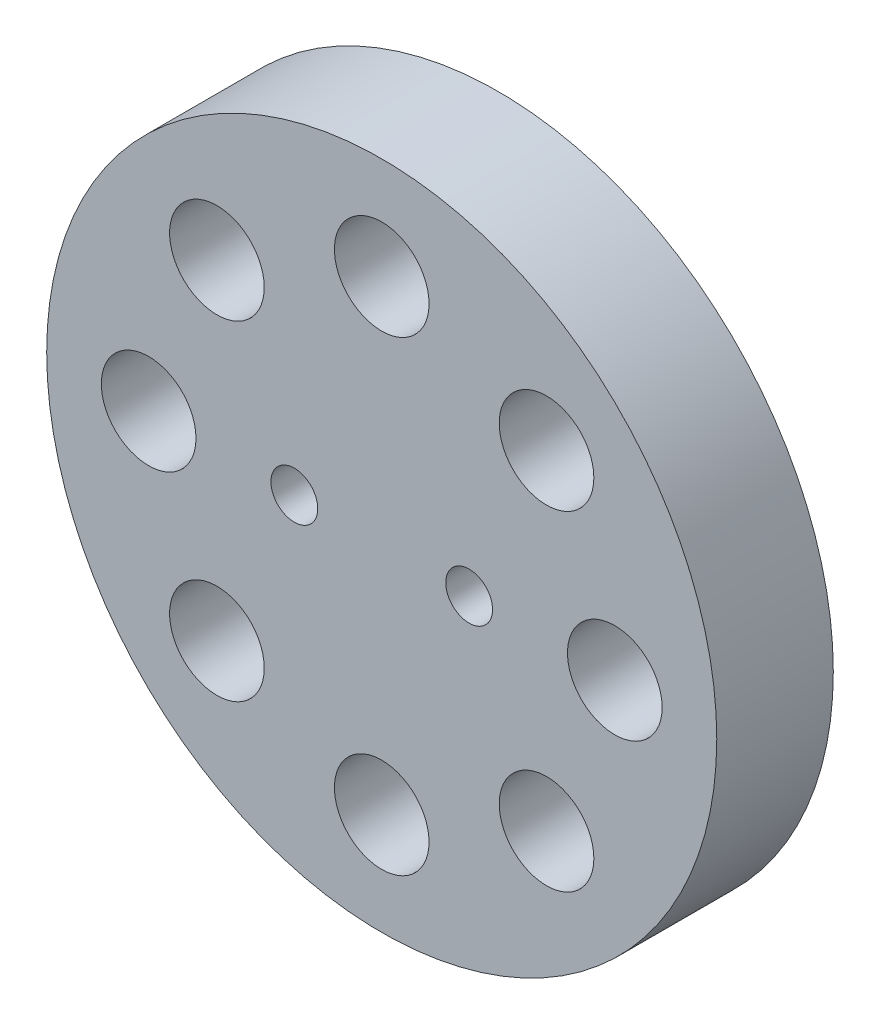
ISO-10303-21;
HEADER;
FILE_DESCRIPTION(('STEP AP214'),'2;1');
FILE_NAME('part.step','',(''),(''),'','','');
FILE_SCHEMA(('AUTOMOTIVE_DESIGN { 1 0 10303 214 1 1 1 1 }'));
ENDSEC;
DATA;
#1=APPLICATION_CONTEXT('core data for automotive mechanical design processes');
#2=APPLICATION_PROTOCOL_DEFINITION('international standard','automotive_design',2000,#1);
#3=PRODUCT_CONTEXT('',#1,'mechanical');
#4=PRODUCT('Part','Part','',(#3));
#5=PRODUCT_RELATED_PRODUCT_CATEGORY('part','',(#4));
#6=PRODUCT_DEFINITION_FORMATION('','',#4);
#7=PRODUCT_DEFINITION_CONTEXT('part definition',#1,'design');
#8=PRODUCT_DEFINITION('design','',#6,#7);
#9=PRODUCT_DEFINITION_SHAPE('','',#8);
#10=(LENGTH_UNIT() NAMED_UNIT(*) SI_UNIT(.MILLI.,.METRE.));
#11=(NAMED_UNIT(*) PLANE_ANGLE_UNIT() SI_UNIT($,.RADIAN.));
#12=(NAMED_UNIT(*) SI_UNIT($,.STERADIAN.) SOLID_ANGLE_UNIT());
#13=UNCERTAINTY_MEASURE_WITH_UNIT(LENGTH_MEASURE(1.E-05),#10,'distance_accuracy_value','');
#14=(GEOMETRIC_REPRESENTATION_CONTEXT(3) GLOBAL_UNCERTAINTY_ASSIGNED_CONTEXT((#13)) GLOBAL_UNIT_ASSIGNED_CONTEXT((#10,
#11,#12)) REPRESENTATION_CONTEXT('',''));
#15=CARTESIAN_POINT('',(0.,0.,0.));
#16=DIRECTION('',(0.,0.,1.));
#17=DIRECTION('',(1.,0.,0.));
#18=AXIS2_PLACEMENT_3D('',#15,#16,#17);
#19=CARTESIAN_POINT('',(0.,0.,12.7));
#20=DIRECTION('',(0.,0.,-1.));
#21=DIRECTION('',(-1.,0.,0.));
#22=AXIS2_PLACEMENT_3D('',#19,#20,#21);
#23=CYLINDRICAL_SURFACE('',#22,36.5125);
#24=CARTESIAN_POINT('',(0.,0.,12.7));
#25=DIRECTION('',(0.,0.,1.));
#26=DIRECTION('',(1.,0.,0.));
#27=AXIS2_PLACEMENT_3D('',#24,#25,#26);
#28=CIRCLE('',#27,36.5125);
#29=CARTESIAN_POINT('',(36.5125,0.,12.7));
#30=VERTEX_POINT('',#29);
#31=EDGE_CURVE('E12',#30,#30,#28,.T.);
#32=ORIENTED_EDGE('',*,*,#31,.F.);
#33=EDGE_LOOP('',(#32));
#34=FACE_BOUND('',#33,.T.);
#35=CARTESIAN_POINT('',(0.,0.,0.));
#36=DIRECTION('',(0.,0.,1.));
#37=DIRECTION('',(1.,0.,0.));
#38=AXIS2_PLACEMENT_3D('',#35,#36,#37);
#39=CIRCLE('',#38,36.5125);
#40=CARTESIAN_POINT('',(36.5125,0.,0.));
#41=VERTEX_POINT('',#40);
#42=EDGE_CURVE('E46',#41,#41,#39,.T.);
#43=ORIENTED_EDGE('',*,*,#42,.T.);
#44=EDGE_LOOP('',(#43));
#45=FACE_BOUND('',#44,.T.);
#46=ADVANCED_FACE('F43',(#34,#45),#23,.T.);
#47=CARTESIAN_POINT('',(0.,0.,12.7));
#48=DIRECTION('',(0.,0.,1.));
#49=DIRECTION('',(1.,0.,0.));
#50=AXIS2_PLACEMENT_3D('',#47,#48,#49);
#51=PLANE('',#50);
#52=CARTESIAN_POINT('',(17.9605122421385,17.9605122421381,12.7));
#53=DIRECTION('',(0.,0.,1.));
#54=DIRECTION('',(1.,0.,0.));
#55=AXIS2_PLACEMENT_3D('',#52,#53,#54);
#56=CIRCLE('',#55,5.1562);
#57=CARTESIAN_POINT('',(23.1167122421385,17.9605122421381,12.7));
#58=VERTEX_POINT('',#57);
#59=EDGE_CURVE('E111',#58,#58,#56,.T.);
#60=ORIENTED_EDGE('',*,*,#59,.F.);
#61=EDGE_LOOP('',(#60));
#62=FACE_BOUND('',#61,.T.);
#63=CARTESIAN_POINT('',(2.66050878019847E-13,25.4,12.7));
#64=DIRECTION('',(0.,0.,1.));
#65=DIRECTION('',(1.,0.,0.));
#66=AXIS2_PLACEMENT_3D('',#63,#64,#65);
#67=CIRCLE('',#66,5.1562);
#68=CARTESIAN_POINT('',(5.15620000000026,25.4,12.7));
#69=VERTEX_POINT('',#68);
#70=EDGE_CURVE('E105',#69,#69,#67,.T.);
#71=ORIENTED_EDGE('',*,*,#70,.F.);
#72=EDGE_LOOP('',(#71));
#73=FACE_BOUND('',#72,.T.);
#74=CARTESIAN_POINT('',(-17.9605122421382,17.9605122421385,12.7));
#75=DIRECTION('',(0.,0.,1.));
#76=DIRECTION('',(1.,0.,0.));
#77=AXIS2_PLACEMENT_3D('',#74,#75,#76);
#78=CIRCLE('',#77,5.1562);
#79=CARTESIAN_POINT('',(-12.8043122421382,17.9605122421385,12.7));
#80=VERTEX_POINT('',#79);
#81=EDGE_CURVE('E99',#80,#80,#78,.T.);
#82=ORIENTED_EDGE('',*,*,#81,.F.);
#83=EDGE_LOOP('',(#82));
#84=FACE_BOUND('',#83,.T.);
#85=CARTESIAN_POINT('',(-25.4,0.,12.7));
#86=DIRECTION('',(0.,0.,1.));
#87=DIRECTION('',(1.,0.,0.));
#88=AXIS2_PLACEMENT_3D('',#85,#86,#87);
#89=CIRCLE('',#88,5.1562);
#90=CARTESIAN_POINT('',(-20.2438,0.,12.7));
#91=VERTEX_POINT('',#90);
#92=EDGE_CURVE('E93',#91,#91,#89,.T.);
#93=ORIENTED_EDGE('',*,*,#92,.F.);
#94=EDGE_LOOP('',(#93));
#95=FACE_BOUND('',#94,.T.);
#96=CARTESIAN_POINT('',(-17.9605122421384,-17.9605122421382,12.7));
#97=DIRECTION('',(0.,0.,1.));
#98=DIRECTION('',(1.,0.,0.));
#99=AXIS2_PLACEMENT_3D('',#96,#97,#98);
#100=CIRCLE('',#99,5.1562);
#101=CARTESIAN_POINT('',(-12.8043122421384,-17.9605122421382,12.7));
#102=VERTEX_POINT('',#101);
#103=EDGE_CURVE('E87',#102,#102,#100,.T.);
#104=ORIENTED_EDGE('',*,*,#103,.F.);
#105=EDGE_LOOP('',(#104));
#106=FACE_BOUND('',#105,.T.);
#107=CARTESIAN_POINT('',(0.,-25.4,12.7));
#108=DIRECTION('',(0.,0.,1.));
#109=DIRECTION('',(1.,0.,0.));
#110=AXIS2_PLACEMENT_3D('',#107,#108,#109);
#111=CIRCLE('',#110,5.1562);
#112=CARTESIAN_POINT('',(5.15619999999991,-25.4,12.7));
#113=VERTEX_POINT('',#112);
#114=EDGE_CURVE('E81',#113,#113,#111,.T.);
#115=ORIENTED_EDGE('',*,*,#114,.F.);
#116=EDGE_LOOP('',(#115));
#117=FACE_BOUND('',#116,.T.);
#118=CARTESIAN_POINT('',(17.9605122421383,-17.9605122421383,12.7));
#119=DIRECTION('',(0.,0.,1.));
#120=DIRECTION('',(1.,0.,0.));
#121=AXIS2_PLACEMENT_3D('',#118,#119,#120);
#122=CIRCLE('',#121,5.1562);
#123=CARTESIAN_POINT('',(23.1167122421383,-17.9605122421383,12.7));
#124=VERTEX_POINT('',#123);
#125=EDGE_CURVE('E75',#124,#124,#122,.T.);
#126=ORIENTED_EDGE('',*,*,#125,.F.);
#127=EDGE_LOOP('',(#126));
#128=FACE_BOUND('',#127,.T.);
#129=CARTESIAN_POINT('',(25.4,0.,12.7));
#130=DIRECTION('',(0.,0.,1.));
#131=DIRECTION('',(1.,0.,0.));
#132=AXIS2_PLACEMENT_3D('',#129,#130,#131);
#133=CIRCLE('',#132,5.1562);
#134=CARTESIAN_POINT('',(30.5562,0.,12.7));
#135=VERTEX_POINT('',#134);
#136=EDGE_CURVE('E69',#135,#135,#133,.T.);
#137=ORIENTED_EDGE('',*,*,#136,.F.);
#138=EDGE_LOOP('',(#137));
#139=FACE_BOUND('',#138,.T.);
#140=CARTESIAN_POINT('',(9.525,0.,12.7));
#141=DIRECTION('',(0.,0.,1.));
#142=DIRECTION('',(1.,0.,0.));
#143=AXIS2_PLACEMENT_3D('',#140,#141,#142);
#144=CIRCLE('',#143,2.55269999999999);
#145=CARTESIAN_POINT('',(12.0777,0.,12.7));
#146=VERTEX_POINT('',#145);
#147=EDGE_CURVE('E63',#146,#146,#144,.T.);
#148=ORIENTED_EDGE('',*,*,#147,.F.);
#149=EDGE_LOOP('',(#148));
#150=FACE_BOUND('',#149,.T.);
#151=CARTESIAN_POINT('',(-9.525,0.,12.7));
#152=DIRECTION('',(0.,0.,1.));
#153=DIRECTION('',(1.,0.,0.));
#154=AXIS2_PLACEMENT_3D('',#151,#152,#153);
#155=CIRCLE('',#154,2.55269999999999);
#156=CARTESIAN_POINT('',(-6.97230000000001,0.,12.7));
#157=VERTEX_POINT('',#156);
#158=EDGE_CURVE('E57',#157,#157,#155,.T.);
#159=ORIENTED_EDGE('',*,*,#158,.F.);
#160=EDGE_LOOP('',(#159));
#161=FACE_BOUND('',#160,.T.);
#162=ORIENTED_EDGE('',*,*,#31,.T.);
#163=EDGE_LOOP('',(#162));
#164=FACE_BOUND('',#163,.T.);
#165=ADVANCED_FACE('F117',(#62,#73,#84,#95,#106,#117,#128,#139,#150,#161,#164),#51,.T.);
#166=CARTESIAN_POINT('',(0.,0.,0.));
#167=DIRECTION('',(0.,0.,1.));
#168=DIRECTION('',(1.,0.,0.));
#169=AXIS2_PLACEMENT_3D('',#166,#167,#168);
#170=PLANE('',#169);
#171=CARTESIAN_POINT('',(17.9605122421385,17.9605122421381,0.));
#172=DIRECTION('',(0.,0.,1.));
#173=DIRECTION('',(1.,0.,0.));
#174=AXIS2_PLACEMENT_3D('',#171,#172,#173);
#175=CIRCLE('',#174,5.1562);
#176=CARTESIAN_POINT('',(23.1167122421385,17.9605122421381,0.));
#177=VERTEX_POINT('',#176);
#178=EDGE_CURVE('E108',#177,#177,#175,.T.);
#179=ORIENTED_EDGE('',*,*,#178,.T.);
#180=EDGE_LOOP('',(#179));
#181=FACE_BOUND('',#180,.T.);
#182=CARTESIAN_POINT('',(2.66050878019847E-13,25.4,0.));
#183=DIRECTION('',(0.,0.,1.));
#184=DIRECTION('',(1.,0.,0.));
#185=AXIS2_PLACEMENT_3D('',#182,#183,#184);
#186=CIRCLE('',#185,5.1562);
#187=CARTESIAN_POINT('',(5.15620000000026,25.4,0.));
#188=VERTEX_POINT('',#187);
#189=EDGE_CURVE('E102',#188,#188,#186,.T.);
#190=ORIENTED_EDGE('',*,*,#189,.T.);
#191=EDGE_LOOP('',(#190));
#192=FACE_BOUND('',#191,.T.);
#193=CARTESIAN_POINT('',(-17.9605122421382,17.9605122421385,0.));
#194=DIRECTION('',(0.,0.,1.));
#195=DIRECTION('',(1.,0.,0.));
#196=AXIS2_PLACEMENT_3D('',#193,#194,#195);
#197=CIRCLE('',#196,5.1562);
#198=CARTESIAN_POINT('',(-12.8043122421382,17.9605122421385,0.));
#199=VERTEX_POINT('',#198);
#200=EDGE_CURVE('E96',#199,#199,#197,.T.);
#201=ORIENTED_EDGE('',*,*,#200,.T.);
#202=EDGE_LOOP('',(#201));
#203=FACE_BOUND('',#202,.T.);
#204=CARTESIAN_POINT('',(-25.4,0.,0.));
#205=DIRECTION('',(0.,0.,1.));
#206=DIRECTION('',(1.,0.,0.));
#207=AXIS2_PLACEMENT_3D('',#204,#205,#206);
#208=CIRCLE('',#207,5.1562);
#209=CARTESIAN_POINT('',(-20.2438,0.,0.));
#210=VERTEX_POINT('',#209);
#211=EDGE_CURVE('E90',#210,#210,#208,.T.);
#212=ORIENTED_EDGE('',*,*,#211,.T.);
#213=EDGE_LOOP('',(#212));
#214=FACE_BOUND('',#213,.T.);
#215=CARTESIAN_POINT('',(-17.9605122421384,-17.9605122421382,0.));
#216=DIRECTION('',(0.,0.,1.));
#217=DIRECTION('',(1.,0.,0.));
#218=AXIS2_PLACEMENT_3D('',#215,#216,#217);
#219=CIRCLE('',#218,5.1562);
#220=CARTESIAN_POINT('',(-12.8043122421384,-17.9605122421382,0.));
#221=VERTEX_POINT('',#220);
#222=EDGE_CURVE('E84',#221,#221,#219,.T.);
#223=ORIENTED_EDGE('',*,*,#222,.T.);
#224=EDGE_LOOP('',(#223));
#225=FACE_BOUND('',#224,.T.);
#226=CARTESIAN_POINT('',(0.,-25.4,0.));
#227=DIRECTION('',(0.,0.,1.));
#228=DIRECTION('',(1.,0.,0.));
#229=AXIS2_PLACEMENT_3D('',#226,#227,#228);
#230=CIRCLE('',#229,5.1562);
#231=CARTESIAN_POINT('',(5.15619999999991,-25.4,0.));
#232=VERTEX_POINT('',#231);
#233=EDGE_CURVE('E78',#232,#232,#230,.T.);
#234=ORIENTED_EDGE('',*,*,#233,.T.);
#235=EDGE_LOOP('',(#234));
#236=FACE_BOUND('',#235,.T.);
#237=CARTESIAN_POINT('',(17.9605122421383,-17.9605122421383,0.));
#238=DIRECTION('',(0.,0.,1.));
#239=DIRECTION('',(1.,0.,0.));
#240=AXIS2_PLACEMENT_3D('',#237,#238,#239);
#241=CIRCLE('',#240,5.1562);
#242=CARTESIAN_POINT('',(23.1167122421383,-17.9605122421383,0.));
#243=VERTEX_POINT('',#242);
#244=EDGE_CURVE('E72',#243,#243,#241,.T.);
#245=ORIENTED_EDGE('',*,*,#244,.T.);
#246=EDGE_LOOP('',(#245));
#247=FACE_BOUND('',#246,.T.);
#248=CARTESIAN_POINT('',(25.4,0.,0.));
#249=DIRECTION('',(0.,0.,1.));
#250=DIRECTION('',(1.,0.,0.));
#251=AXIS2_PLACEMENT_3D('',#248,#249,#250);
#252=CIRCLE('',#251,5.1562);
#253=CARTESIAN_POINT('',(30.5562,0.,0.));
#254=VERTEX_POINT('',#253);
#255=EDGE_CURVE('E66',#254,#254,#252,.T.);
#256=ORIENTED_EDGE('',*,*,#255,.T.);
#257=EDGE_LOOP('',(#256));
#258=FACE_BOUND('',#257,.T.);
#259=CARTESIAN_POINT('',(9.525,0.,0.));
#260=DIRECTION('',(0.,0.,1.));
#261=DIRECTION('',(1.,0.,0.));
#262=AXIS2_PLACEMENT_3D('',#259,#260,#261);
#263=CIRCLE('',#262,2.5527);
#264=CARTESIAN_POINT('',(12.0777,0.,0.));
#265=VERTEX_POINT('',#264);
#266=EDGE_CURVE('E60',#265,#265,#263,.T.);
#267=ORIENTED_EDGE('',*,*,#266,.T.);
#268=EDGE_LOOP('',(#267));
#269=FACE_BOUND('',#268,.T.);
#270=CARTESIAN_POINT('',(-9.525,0.,0.));
#271=DIRECTION('',(0.,0.,1.));
#272=DIRECTION('',(1.,0.,0.));
#273=AXIS2_PLACEMENT_3D('',#270,#271,#272);
#274=CIRCLE('',#273,2.5527);
#275=CARTESIAN_POINT('',(-6.9723,0.,0.));
#276=VERTEX_POINT('',#275);
#277=EDGE_CURVE('E53',#276,#276,#274,.T.);
#278=ORIENTED_EDGE('',*,*,#277,.T.);
#279=EDGE_LOOP('',(#278));
#280=FACE_BOUND('',#279,.T.);
#281=ORIENTED_EDGE('',*,*,#42,.F.);
#282=EDGE_LOOP('',(#281));
#283=FACE_BOUND('',#282,.T.);
#284=ADVANCED_FACE('F120',(#181,#192,#203,#214,#225,#236,#247,#258,#269,#280,#283),#170,.F.);
#285=CARTESIAN_POINT('',(-9.525,0.,12.7));
#286=DIRECTION('',(0.,0.,1.));
#287=DIRECTION('',(1.,0.,0.));
#288=AXIS2_PLACEMENT_3D('',#285,#286,#287);
#289=CYLINDRICAL_SURFACE('',#288,2.55269999999999);
#290=ORIENTED_EDGE('',*,*,#277,.F.);
#291=EDGE_LOOP('',(#290));
#292=FACE_BOUND('',#291,.T.);
#293=ORIENTED_EDGE('',*,*,#158,.T.);
#294=EDGE_LOOP('',(#293));
#295=FACE_BOUND('',#294,.T.);
#296=ADVANCED_FACE('F140',(#292,#295),#289,.F.);
#297=CARTESIAN_POINT('',(9.525,0.,12.7));
#298=DIRECTION('',(0.,0.,1.));
#299=DIRECTION('',(1.,0.,0.));
#300=AXIS2_PLACEMENT_3D('',#297,#298,#299);
#301=CYLINDRICAL_SURFACE('',#300,2.55269999999999);
#302=ORIENTED_EDGE('',*,*,#266,.F.);
#303=EDGE_LOOP('',(#302));
#304=FACE_BOUND('',#303,.T.);
#305=ORIENTED_EDGE('',*,*,#147,.T.);
#306=EDGE_LOOP('',(#305));
#307=FACE_BOUND('',#306,.T.);
#308=ADVANCED_FACE('F142',(#304,#307),#301,.F.);
#309=CARTESIAN_POINT('',(25.4,0.,12.7));
#310=DIRECTION('',(0.,0.,1.));
#311=DIRECTION('',(1.,0.,0.));
#312=AXIS2_PLACEMENT_3D('',#309,#310,#311);
#313=CYLINDRICAL_SURFACE('',#312,5.1562);
#314=ORIENTED_EDGE('',*,*,#255,.F.);
#315=EDGE_LOOP('',(#314));
#316=FACE_BOUND('',#315,.T.);
#317=ORIENTED_EDGE('',*,*,#136,.T.);
#318=EDGE_LOOP('',(#317));
#319=FACE_BOUND('',#318,.T.);
#320=ADVANCED_FACE('F149',(#316,#319),#313,.F.);
#321=CARTESIAN_POINT('',(17.9605122421383,-17.9605122421383,12.7));
#322=DIRECTION('',(0.,0.,1.));
#323=DIRECTION('',(1.,0.,0.));
#324=AXIS2_PLACEMENT_3D('',#321,#322,#323);
#325=CYLINDRICAL_SURFACE('',#324,5.1562);
#326=ORIENTED_EDGE('',*,*,#244,.F.);
#327=EDGE_LOOP('',(#326));
#328=FACE_BOUND('',#327,.T.);
#329=ORIENTED_EDGE('',*,*,#125,.T.);
#330=EDGE_LOOP('',(#329));
#331=FACE_BOUND('',#330,.T.);
#332=ADVANCED_FACE('F176',(#328,#331),#325,.F.);
#333=CARTESIAN_POINT('',(0.,-25.4,12.7));
#334=DIRECTION('',(0.,0.,1.));
#335=DIRECTION('',(1.,0.,0.));
#336=AXIS2_PLACEMENT_3D('',#333,#334,#335);
#337=CYLINDRICAL_SURFACE('',#336,5.1562);
#338=ORIENTED_EDGE('',*,*,#233,.F.);
#339=EDGE_LOOP('',(#338));
#340=FACE_BOUND('',#339,.T.);
#341=ORIENTED_EDGE('',*,*,#114,.T.);
#342=EDGE_LOOP('',(#341));
#343=FACE_BOUND('',#342,.T.);
#344=ADVANCED_FACE('F181',(#340,#343),#337,.F.);
#345=CARTESIAN_POINT('',(-17.9605122421384,-17.9605122421382,12.7));
#346=DIRECTION('',(0.,0.,1.));
#347=DIRECTION('',(1.,0.,0.));
#348=AXIS2_PLACEMENT_3D('',#345,#346,#347);
#349=CYLINDRICAL_SURFACE('',#348,5.1562);
#350=ORIENTED_EDGE('',*,*,#222,.F.);
#351=EDGE_LOOP('',(#350));
#352=FACE_BOUND('',#351,.T.);
#353=ORIENTED_EDGE('',*,*,#103,.T.);
#354=EDGE_LOOP('',(#353));
#355=FACE_BOUND('',#354,.T.);
#356=ADVANCED_FACE('F193',(#352,#355),#349,.F.);
#357=CARTESIAN_POINT('',(-25.4,0.,12.7));
#358=DIRECTION('',(0.,0.,1.));
#359=DIRECTION('',(1.,0.,0.));
#360=AXIS2_PLACEMENT_3D('',#357,#358,#359);
#361=CYLINDRICAL_SURFACE('',#360,5.1562);
#362=ORIENTED_EDGE('',*,*,#211,.F.);
#363=EDGE_LOOP('',(#362));
#364=FACE_BOUND('',#363,.T.);
#365=ORIENTED_EDGE('',*,*,#92,.T.);
#366=EDGE_LOOP('',(#365));
#367=FACE_BOUND('',#366,.T.);
#368=ADVANCED_FACE('F203',(#364,#367),#361,.F.);
#369=CARTESIAN_POINT('',(-17.9605122421382,17.9605122421385,12.7));
#370=DIRECTION('',(0.,0.,1.));
#371=DIRECTION('',(1.,0.,0.));
#372=AXIS2_PLACEMENT_3D('',#369,#370,#371);
#373=CYLINDRICAL_SURFACE('',#372,5.1562);
#374=ORIENTED_EDGE('',*,*,#200,.F.);
#375=EDGE_LOOP('',(#374));
#376=FACE_BOUND('',#375,.T.);
#377=ORIENTED_EDGE('',*,*,#81,.T.);
#378=EDGE_LOOP('',(#377));
#379=FACE_BOUND('',#378,.T.);
#380=ADVANCED_FACE('F213',(#376,#379),#373,.F.);
#381=CARTESIAN_POINT('',(2.66050878019847E-13,25.4,12.7));
#382=DIRECTION('',(0.,0.,1.));
#383=DIRECTION('',(1.,0.,0.));
#384=AXIS2_PLACEMENT_3D('',#381,#382,#383);
#385=CYLINDRICAL_SURFACE('',#384,5.1562);
#386=ORIENTED_EDGE('',*,*,#189,.F.);
#387=EDGE_LOOP('',(#386));
#388=FACE_BOUND('',#387,.T.);
#389=ORIENTED_EDGE('',*,*,#70,.T.);
#390=EDGE_LOOP('',(#389));
#391=FACE_BOUND('',#390,.T.);
#392=ADVANCED_FACE('F223',(#388,#391),#385,.F.);
#393=CARTESIAN_POINT('',(17.9605122421385,17.9605122421381,12.7));
#394=DIRECTION('',(0.,0.,1.));
#395=DIRECTION('',(1.,0.,0.));
#396=AXIS2_PLACEMENT_3D('',#393,#394,#395);
#397=CYLINDRICAL_SURFACE('',#396,5.1562);
#398=ORIENTED_EDGE('',*,*,#178,.F.);
#399=EDGE_LOOP('',(#398));
#400=FACE_BOUND('',#399,.T.);
#401=ORIENTED_EDGE('',*,*,#59,.T.);
#402=EDGE_LOOP('',(#401));
#403=FACE_BOUND('',#402,.T.);
#404=ADVANCED_FACE('F115',(#400,#403),#397,.F.);
#405=CLOSED_SHELL('',(#46,#165,#284,#296,#308,#320,#332,#344,#356,#368,#380,#392,#404));
#406=MANIFOLD_SOLID_BREP('B2',#405);
#407=ADVANCED_BREP_SHAPE_REPRESENTATION('',(#18,#406),#14);
#408=SHAPE_DEFINITION_REPRESENTATION(#9,#407);
ENDSEC;
END-ISO-10303-21;
